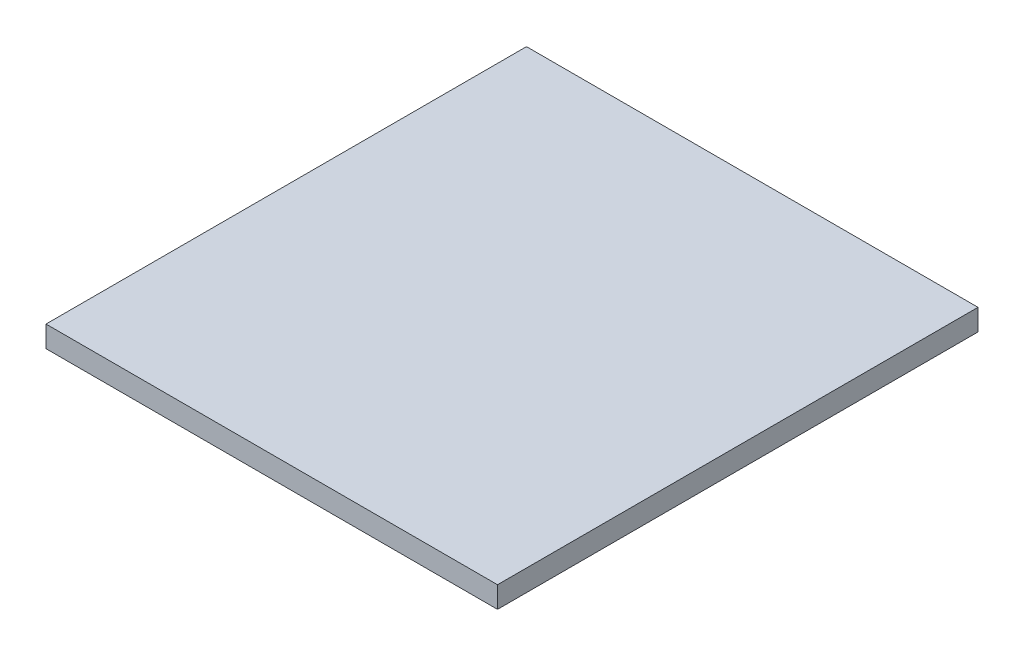
ISO-10303-21;
HEADER;
FILE_DESCRIPTION(('STEP AP214'),'2;1');
FILE_NAME('part.step','',(''),(''),'','','');
FILE_SCHEMA(('AUTOMOTIVE_DESIGN { 1 0 10303 214 1 1 1 1 }'));
ENDSEC;
DATA;
#1=APPLICATION_CONTEXT('core data for automotive mechanical design processes');
#2=APPLICATION_PROTOCOL_DEFINITION('international standard','automotive_design',2000,#1);
#3=PRODUCT_CONTEXT('',#1,'mechanical');
#4=PRODUCT('Part','Part','',(#3));
#5=PRODUCT_RELATED_PRODUCT_CATEGORY('part','',(#4));
#6=PRODUCT_DEFINITION_FORMATION('','',#4);
#7=PRODUCT_DEFINITION_CONTEXT('part definition',#1,'design');
#8=PRODUCT_DEFINITION('design','',#6,#7);
#9=PRODUCT_DEFINITION_SHAPE('','',#8);
#10=(LENGTH_UNIT() NAMED_UNIT(*) SI_UNIT(.MILLI.,.METRE.));
#11=(NAMED_UNIT(*) PLANE_ANGLE_UNIT() SI_UNIT($,.RADIAN.));
#12=(NAMED_UNIT(*) SI_UNIT($,.STERADIAN.) SOLID_ANGLE_UNIT());
#13=UNCERTAINTY_MEASURE_WITH_UNIT(LENGTH_MEASURE(1.E-05),#10,'distance_accuracy_value','');
#14=(GEOMETRIC_REPRESENTATION_CONTEXT(3) GLOBAL_UNCERTAINTY_ASSIGNED_CONTEXT((#13)) GLOBAL_UNIT_ASSIGNED_CONTEXT((#10,
#11,#12)) REPRESENTATION_CONTEXT('',''));
#15=CARTESIAN_POINT('',(0.,0.,0.));
#16=DIRECTION('',(0.,0.,1.));
#17=DIRECTION('',(1.,0.,0.));
#18=AXIS2_PLACEMENT_3D('',#15,#16,#17);
#19=CARTESIAN_POINT('',(211.43,20.,225.));
#20=DIRECTION('',(-1.,0.,0.));
#21=DIRECTION('',(0.,0.,1.));
#22=AXIS2_PLACEMENT_3D('',#19,#20,#21);
#23=PLANE('',#22);
#24=DIRECTION('',(0.,0.,-1.));
#25=VECTOR('',#24,1.);
#26=CARTESIAN_POINT('',(211.43,0.,225.));
#27=LINE('',#26,#25);
#28=CARTESIAN_POINT('',(211.43,0.,225.));
#29=VERTEX_POINT('',#28);
#30=CARTESIAN_POINT('',(211.43,0.,-225.));
#31=VERTEX_POINT('',#30);
#32=EDGE_CURVE('E109',#29,#31,#27,.T.);
#33=ORIENTED_EDGE('',*,*,#32,.T.);
#34=DIRECTION('',(0.,-1.,0.));
#35=VECTOR('',#34,1.);
#36=CARTESIAN_POINT('',(211.43,20.,-225.));
#37=LINE('',#36,#35);
#38=CARTESIAN_POINT('',(211.43,20.,-225.));
#39=VERTEX_POINT('',#38);
#40=EDGE_CURVE('E11',#39,#31,#37,.T.);
#41=ORIENTED_EDGE('',*,*,#40,.F.);
#42=DIRECTION('',(0.,0.,-1.));
#43=VECTOR('',#42,1.);
#44=CARTESIAN_POINT('',(211.43,20.,225.));
#45=LINE('',#44,#43);
#46=CARTESIAN_POINT('',(211.43,20.,225.));
#47=VERTEX_POINT('',#46);
#48=EDGE_CURVE('E93',#47,#39,#45,.T.);
#49=ORIENTED_EDGE('',*,*,#48,.F.);
#50=DIRECTION('',(0.,-1.,0.));
#51=VECTOR('',#50,1.);
#52=CARTESIAN_POINT('',(211.43,20.,225.));
#53=LINE('',#52,#51);
#54=EDGE_CURVE('E105',#47,#29,#53,.T.);
#55=ORIENTED_EDGE('',*,*,#54,.T.);
#56=EDGE_LOOP('',(#33,#41,#49,#55));
#57=FACE_BOUND('',#56,.T.);
#58=ADVANCED_FACE('F41',(#57),#23,.F.);
#59=CARTESIAN_POINT('',(-211.43,20.,-225.));
#60=DIRECTION('',(0.,0.,1.));
#61=DIRECTION('',(1.,0.,0.));
#62=AXIS2_PLACEMENT_3D('',#59,#60,#61);
#63=PLANE('',#62);
#64=DIRECTION('',(-1.,0.,0.));
#65=VECTOR('',#64,1.);
#66=CARTESIAN_POINT('',(-211.43,0.,-225.));
#67=LINE('',#66,#65);
#68=CARTESIAN_POINT('',(-211.43,0.,-225.));
#69=VERTEX_POINT('',#68);
#70=EDGE_CURVE('E98',#31,#69,#67,.T.);
#71=ORIENTED_EDGE('',*,*,#70,.T.);
#72=DIRECTION('',(0.,-1.,0.));
#73=VECTOR('',#72,1.);
#74=CARTESIAN_POINT('',(-211.43,20.,-225.));
#75=LINE('',#74,#73);
#76=CARTESIAN_POINT('',(-211.43,20.,-225.));
#77=VERTEX_POINT('',#76);
#78=EDGE_CURVE('E50',#77,#69,#75,.T.);
#79=ORIENTED_EDGE('',*,*,#78,.F.);
#80=DIRECTION('',(-1.,0.,0.));
#81=VECTOR('',#80,1.);
#82=CARTESIAN_POINT('',(-211.43,20.,-225.));
#83=LINE('',#82,#81);
#84=EDGE_CURVE('E88',#39,#77,#83,.T.);
#85=ORIENTED_EDGE('',*,*,#84,.F.);
#86=ORIENTED_EDGE('',*,*,#40,.T.);
#87=EDGE_LOOP('',(#71,#79,#85,#86));
#88=FACE_BOUND('',#87,.T.);
#89=ADVANCED_FACE('F97',(#88),#63,.F.);
#90=CARTESIAN_POINT('',(-211.43,20.,225.));
#91=DIRECTION('',(1.,0.,0.));
#92=DIRECTION('',(0.,0.,-1.));
#93=AXIS2_PLACEMENT_3D('',#90,#91,#92);
#94=PLANE('',#93);
#95=DIRECTION('',(0.,0.,1.));
#96=VECTOR('',#95,1.);
#97=CARTESIAN_POINT('',(-211.43,0.,225.));
#98=LINE('',#97,#96);
#99=CARTESIAN_POINT('',(-211.43,0.,225.));
#100=VERTEX_POINT('',#99);
#101=EDGE_CURVE('E75',#69,#100,#98,.T.);
#102=ORIENTED_EDGE('',*,*,#101,.T.);
#103=DIRECTION('',(0.,-1.,0.));
#104=VECTOR('',#103,1.);
#105=CARTESIAN_POINT('',(-211.43,20.,225.));
#106=LINE('',#105,#104);
#107=CARTESIAN_POINT('',(-211.43,20.,225.));
#108=VERTEX_POINT('',#107);
#109=EDGE_CURVE('E100',#108,#100,#106,.T.);
#110=ORIENTED_EDGE('',*,*,#109,.F.);
#111=DIRECTION('',(0.,0.,1.));
#112=VECTOR('',#111,1.);
#113=CARTESIAN_POINT('',(-211.43,20.,225.));
#114=LINE('',#113,#112);
#115=EDGE_CURVE('E91',#77,#108,#114,.T.);
#116=ORIENTED_EDGE('',*,*,#115,.F.);
#117=ORIENTED_EDGE('',*,*,#78,.T.);
#118=EDGE_LOOP('',(#102,#110,#116,#117));
#119=FACE_BOUND('',#118,.T.);
#120=ADVANCED_FACE('F101',(#119),#94,.F.);
#121=CARTESIAN_POINT('',(-211.43,20.,225.));
#122=DIRECTION('',(0.,0.,-1.));
#123=DIRECTION('',(-1.,0.,0.));
#124=AXIS2_PLACEMENT_3D('',#121,#122,#123);
#125=PLANE('',#124);
#126=DIRECTION('',(1.,0.,0.));
#127=VECTOR('',#126,1.);
#128=CARTESIAN_POINT('',(-211.43,0.,225.));
#129=LINE('',#128,#127);
#130=EDGE_CURVE('E81',#100,#29,#129,.T.);
#131=ORIENTED_EDGE('',*,*,#130,.T.);
#132=ORIENTED_EDGE('',*,*,#54,.F.);
#133=DIRECTION('',(1.,0.,0.));
#134=VECTOR('',#133,1.);
#135=CARTESIAN_POINT('',(-211.43,20.,225.));
#136=LINE('',#135,#134);
#137=EDGE_CURVE('E58',#108,#47,#136,.T.);
#138=ORIENTED_EDGE('',*,*,#137,.F.);
#139=ORIENTED_EDGE('',*,*,#109,.T.);
#140=EDGE_LOOP('',(#131,#132,#138,#139));
#141=FACE_BOUND('',#140,.T.);
#142=ADVANCED_FACE('F122',(#141),#125,.F.);
#143=CARTESIAN_POINT('',(0.,20.,0.));
#144=DIRECTION('',(0.,-1.,0.));
#145=DIRECTION('',(0.,0.,-1.));
#146=AXIS2_PLACEMENT_3D('',#143,#144,#145);
#147=PLANE('',#146);
#148=ORIENTED_EDGE('',*,*,#48,.T.);
#149=ORIENTED_EDGE('',*,*,#84,.T.);
#150=ORIENTED_EDGE('',*,*,#115,.T.);
#151=ORIENTED_EDGE('',*,*,#137,.T.);
#152=EDGE_LOOP('',(#148,#149,#150,#151));
#153=FACE_BOUND('',#152,.T.);
#154=ADVANCED_FACE('F89',(#153),#147,.F.);
#155=CARTESIAN_POINT('',(0.,0.,0.));
#156=DIRECTION('',(0.,-1.,0.));
#157=DIRECTION('',(0.,0.,-1.));
#158=AXIS2_PLACEMENT_3D('',#155,#156,#157);
#159=PLANE('',#158);
#160=ORIENTED_EDGE('',*,*,#32,.F.);
#161=ORIENTED_EDGE('',*,*,#130,.F.);
#162=ORIENTED_EDGE('',*,*,#101,.F.);
#163=ORIENTED_EDGE('',*,*,#70,.F.);
#164=EDGE_LOOP('',(#160,#161,#162,#163));
#165=FACE_BOUND('',#164,.T.);
#166=ADVANCED_FACE('F125',(#165),#159,.T.);
#167=CLOSED_SHELL('',(#58,#89,#120,#142,#154,#166));
#168=MANIFOLD_SOLID_BREP('B2',#167);
#169=ADVANCED_BREP_SHAPE_REPRESENTATION('',(#18,#168),#14);
#170=SHAPE_DEFINITION_REPRESENTATION(#9,#169);
ENDSEC;
END-ISO-10303-21;
